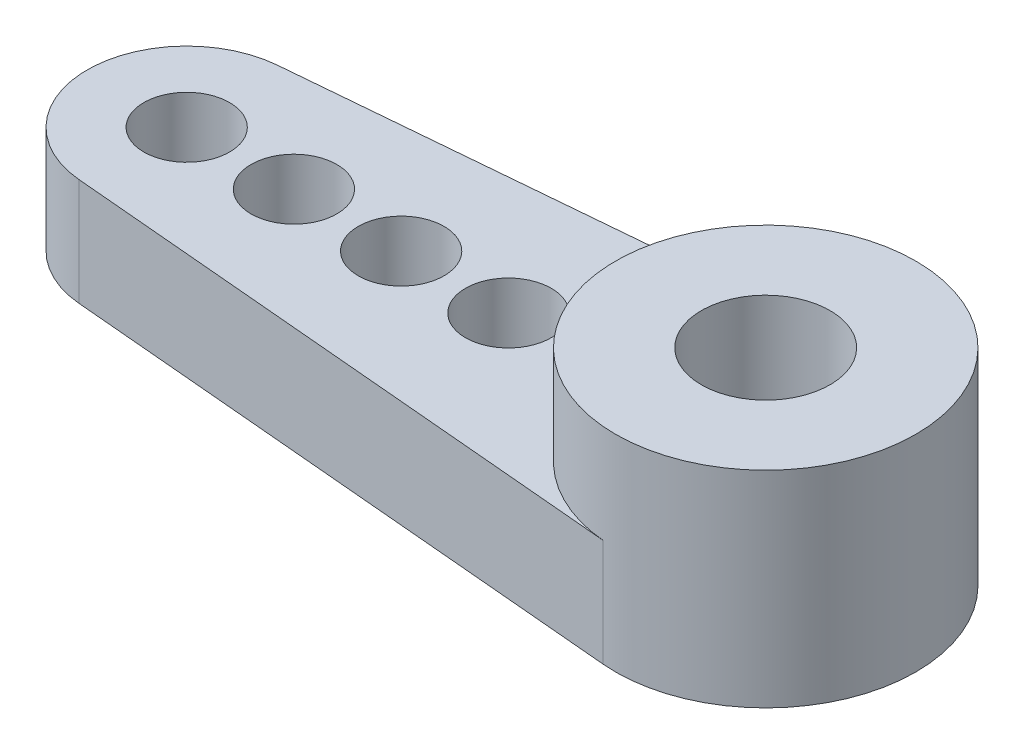
ISO-10303-21;
HEADER;
FILE_DESCRIPTION(('STEP AP214'),'2;1');
FILE_NAME('part.step','',(''),(''),'','','');
FILE_SCHEMA(('AUTOMOTIVE_DESIGN { 1 0 10303 214 1 1 1 1 }'));
ENDSEC;
DATA;
#1=APPLICATION_CONTEXT('core data for automotive mechanical design processes');
#2=APPLICATION_PROTOCOL_DEFINITION('international standard','automotive_design',2000,#1);
#3=PRODUCT_CONTEXT('',#1,'mechanical');
#4=PRODUCT('Part','Part','',(#3));
#5=PRODUCT_RELATED_PRODUCT_CATEGORY('part','',(#4));
#6=PRODUCT_DEFINITION_FORMATION('','',#4);
#7=PRODUCT_DEFINITION_CONTEXT('part definition',#1,'design');
#8=PRODUCT_DEFINITION('design','',#6,#7);
#9=PRODUCT_DEFINITION_SHAPE('','',#8);
#10=(LENGTH_UNIT() NAMED_UNIT(*) SI_UNIT(.MILLI.,.METRE.));
#11=(NAMED_UNIT(*) PLANE_ANGLE_UNIT() SI_UNIT($,.RADIAN.));
#12=(NAMED_UNIT(*) SI_UNIT($,.STERADIAN.) SOLID_ANGLE_UNIT());
#13=UNCERTAINTY_MEASURE_WITH_UNIT(LENGTH_MEASURE(1.E-05),#10,'distance_accuracy_value','');
#14=(GEOMETRIC_REPRESENTATION_CONTEXT(3) GLOBAL_UNCERTAINTY_ASSIGNED_CONTEXT((#13)) GLOBAL_UNIT_ASSIGNED_CONTEXT((#10,
#11,#12)) REPRESENTATION_CONTEXT('',''));
#15=CARTESIAN_POINT('',(0.,0.,0.));
#16=DIRECTION('',(0.,0.,1.));
#17=DIRECTION('',(1.,0.,0.));
#18=AXIS2_PLACEMENT_3D('',#15,#16,#17);
#19=CARTESIAN_POINT('',(-0.305925925925926,2.5,-3.48660426889063));
#20=DIRECTION('',(0.0874074074074074,0.,0.996172648254466));
#21=DIRECTION('',(0.996172648254466,0.,-0.0874074074074074));
#22=AXIS2_PLACEMENT_3D('',#19,#20,#21);
#23=PLANE('',#22);
#24=DIRECTION('',(-0.996172648254466,0.,0.0874074074074074));
#25=VECTOR('',#24,1.);
#26=CARTESIAN_POINT('',(-0.305925925925926,0.,-3.48660426889063));
#27=LINE('',#26,#25);
#28=CARTESIAN_POINT('',(-0.305925925925926,0.,-3.48660426889063));
#29=VERTEX_POINT('',#28);
#30=CARTESIAN_POINT('',(-13.7027851851852,0.,-2.31112054395036));
#31=VERTEX_POINT('',#30);
#32=EDGE_CURVE('E84',#29,#31,#27,.T.);
#33=ORIENTED_EDGE('',*,*,#32,.T.);
#34=DIRECTION('',(0.,-1.,0.));
#35=VECTOR('',#34,1.);
#36=CARTESIAN_POINT('',(-13.7027851851852,2.5,-2.31112054395036));
#37=LINE('',#36,#35);
#38=CARTESIAN_POINT('',(-13.7027851851852,2.5,-2.31112054395036));
#39=VERTEX_POINT('',#38);
#40=EDGE_CURVE('E11',#39,#31,#37,.T.);
#41=ORIENTED_EDGE('',*,*,#40,.F.);
#42=DIRECTION('',(-0.996172648254466,0.,0.0874074074074074));
#43=VECTOR('',#42,1.);
#44=CARTESIAN_POINT('',(-0.305925925925926,2.5,-3.48660426889063));
#45=LINE('',#44,#43);
#46=CARTESIAN_POINT('',(-0.305925925925926,2.5,-3.48660426889063));
#47=VERTEX_POINT('',#46);
#48=EDGE_CURVE('E130',#47,#39,#45,.T.);
#49=ORIENTED_EDGE('',*,*,#48,.F.);
#50=DIRECTION('',(0.,-1.,0.));
#51=VECTOR('',#50,1.);
#52=CARTESIAN_POINT('',(-0.305925925925926,2.5,-3.48660426889063));
#53=LINE('',#52,#51);
#54=EDGE_CURVE('E98',#47,#29,#53,.T.);
#55=ORIENTED_EDGE('',*,*,#54,.T.);
#56=EDGE_LOOP('',(#33,#41,#49,#55));
#57=FACE_BOUND('',#56,.T.);
#58=ADVANCED_FACE('F41',(#57),#23,.F.);
#59=CARTESIAN_POINT('',(-13.5,2.5,0.));
#60=DIRECTION('',(0.,-1.,0.));
#61=DIRECTION('',(0.,0.,-1.));
#62=AXIS2_PLACEMENT_3D('',#59,#60,#61);
#63=CYLINDRICAL_SURFACE('',#62,2.32);
#64=CARTESIAN_POINT('',(-13.5,0.,0.));
#65=DIRECTION('',(0.,1.,0.));
#66=DIRECTION('',(0.,0.,1.));
#67=AXIS2_PLACEMENT_3D('',#64,#65,#66);
#68=CIRCLE('',#67,2.32);
#69=CARTESIAN_POINT('',(-13.7027851851852,0.,2.31112054395036));
#70=VERTEX_POINT('',#69);
#71=EDGE_CURVE('E102',#31,#70,#68,.T.);
#72=ORIENTED_EDGE('',*,*,#71,.T.);
#73=DIRECTION('',(0.,-1.,0.));
#74=VECTOR('',#73,1.);
#75=CARTESIAN_POINT('',(-13.7027851851852,2.5,2.31112054395036));
#76=LINE('',#75,#74);
#77=CARTESIAN_POINT('',(-13.7027851851852,2.5,2.31112054395036));
#78=VERTEX_POINT('',#77);
#79=EDGE_CURVE('E50',#78,#70,#76,.T.);
#80=ORIENTED_EDGE('',*,*,#79,.F.);
#81=CARTESIAN_POINT('',(-13.5,2.5,0.));
#82=DIRECTION('',(0.,1.,0.));
#83=DIRECTION('',(0.,0.,1.));
#84=AXIS2_PLACEMENT_3D('',#81,#82,#83);
#85=CIRCLE('',#84,2.32);
#86=EDGE_CURVE('E58',#39,#78,#85,.T.);
#87=ORIENTED_EDGE('',*,*,#86,.F.);
#88=ORIENTED_EDGE('',*,*,#40,.T.);
#89=EDGE_LOOP('',(#72,#80,#87,#88));
#90=FACE_BOUND('',#89,.T.);
#91=ADVANCED_FACE('F132',(#90),#63,.T.);
#92=CARTESIAN_POINT('',(-0.305925925925925,2.5,3.48660426889063));
#93=DIRECTION('',(-0.0874074074074072,0.,0.996172648254466));
#94=DIRECTION('',(0.996172648254466,0.,0.0874074074074072));
#95=AXIS2_PLACEMENT_3D('',#92,#93,#94);
#96=PLANE('',#95);
#97=DIRECTION('',(-0.996172648254466,0.,-0.0874074074074072));
#98=VECTOR('',#97,1.);
#99=CARTESIAN_POINT('',(-0.305925925925925,0.,3.48660426889063));
#100=LINE('',#99,#98);
#101=CARTESIAN_POINT('',(-0.305925925925925,0.,3.48660426889063));
#102=VERTEX_POINT('',#101);
#103=EDGE_CURVE('E81',#102,#70,#100,.T.);
#104=ORIENTED_EDGE('',*,*,#103,.F.);
#105=DIRECTION('',(0.,-1.,0.));
#106=VECTOR('',#105,1.);
#107=CARTESIAN_POINT('',(-0.305925925925925,2.5,3.48660426889063));
#108=LINE('',#107,#106);
#109=CARTESIAN_POINT('',(-0.305925925925925,2.5,3.48660426889063));
#110=VERTEX_POINT('',#109);
#111=EDGE_CURVE('E93',#110,#102,#108,.T.);
#112=ORIENTED_EDGE('',*,*,#111,.F.);
#113=DIRECTION('',(-0.996172648254466,0.,-0.0874074074074072));
#114=VECTOR('',#113,1.);
#115=CARTESIAN_POINT('',(-0.305925925925925,2.5,3.48660426889063));
#116=LINE('',#115,#114);
#117=EDGE_CURVE('E112',#110,#78,#116,.T.);
#118=ORIENTED_EDGE('',*,*,#117,.T.);
#119=ORIENTED_EDGE('',*,*,#79,.T.);
#120=EDGE_LOOP('',(#104,#112,#118,#119));
#121=FACE_BOUND('',#120,.T.);
#122=ADVANCED_FACE('F100',(#121),#96,.T.);
#123=CARTESIAN_POINT('',(-13.5,2.5,0.));
#124=DIRECTION('',(0.,-1.,0.));
#125=DIRECTION('',(0.,0.,-1.));
#126=AXIS2_PLACEMENT_3D('',#123,#124,#125);
#127=CYLINDRICAL_SURFACE('',#126,1.);
#128=CARTESIAN_POINT('',(-13.5,2.5,0.));
#129=DIRECTION('',(0.,1.,0.));
#130=DIRECTION('',(0.,0.,1.));
#131=AXIS2_PLACEMENT_3D('',#128,#129,#130);
#132=CIRCLE('',#131,1.);
#133=CARTESIAN_POINT('',(-13.5,2.5,1.));
#134=VERTEX_POINT('',#133);
#135=EDGE_CURVE('E134',#134,#134,#132,.T.);
#136=ORIENTED_EDGE('',*,*,#135,.T.);
#137=EDGE_LOOP('',(#136));
#138=FACE_BOUND('',#137,.T.);
#139=CARTESIAN_POINT('',(-13.5,0.,0.));
#140=DIRECTION('',(0.,1.,0.));
#141=DIRECTION('',(0.,0.,1.));
#142=AXIS2_PLACEMENT_3D('',#139,#140,#141);
#143=CIRCLE('',#142,1.);
#144=CARTESIAN_POINT('',(-13.5,0.,1.));
#145=VERTEX_POINT('',#144);
#146=EDGE_CURVE('E127',#145,#145,#143,.T.);
#147=ORIENTED_EDGE('',*,*,#146,.F.);
#148=EDGE_LOOP('',(#147));
#149=FACE_BOUND('',#148,.T.);
#150=ADVANCED_FACE('F177',(#138,#149),#127,.F.);
#151=CARTESIAN_POINT('',(-11.,2.5,0.));
#152=DIRECTION('',(0.,-1.,0.));
#153=DIRECTION('',(0.,0.,-1.));
#154=AXIS2_PLACEMENT_3D('',#151,#152,#153);
#155=CYLINDRICAL_SURFACE('',#154,1.);
#156=CARTESIAN_POINT('',(-11.,2.5,0.));
#157=DIRECTION('',(0.,1.,0.));
#158=DIRECTION('',(0.,0.,1.));
#159=AXIS2_PLACEMENT_3D('',#156,#157,#158);
#160=CIRCLE('',#159,1.);
#161=CARTESIAN_POINT('',(-11.,2.5,1.));
#162=VERTEX_POINT('',#161);
#163=EDGE_CURVE('E137',#162,#162,#160,.T.);
#164=ORIENTED_EDGE('',*,*,#163,.T.);
#165=EDGE_LOOP('',(#164));
#166=FACE_BOUND('',#165,.T.);
#167=CARTESIAN_POINT('',(-11.,0.,0.));
#168=DIRECTION('',(0.,1.,0.));
#169=DIRECTION('',(0.,0.,1.));
#170=AXIS2_PLACEMENT_3D('',#167,#168,#169);
#171=CIRCLE('',#170,1.);
#172=CARTESIAN_POINT('',(-11.,0.,1.));
#173=VERTEX_POINT('',#172);
#174=EDGE_CURVE('E124',#173,#173,#171,.T.);
#175=ORIENTED_EDGE('',*,*,#174,.F.);
#176=EDGE_LOOP('',(#175));
#177=FACE_BOUND('',#176,.T.);
#178=ADVANCED_FACE('F180',(#166,#177),#155,.F.);
#179=CARTESIAN_POINT('',(-8.5,2.5,0.));
#180=DIRECTION('',(0.,-1.,0.));
#181=DIRECTION('',(0.,0.,-1.));
#182=AXIS2_PLACEMENT_3D('',#179,#180,#181);
#183=CYLINDRICAL_SURFACE('',#182,1.);
#184=CARTESIAN_POINT('',(-8.5,2.5,0.));
#185=DIRECTION('',(0.,1.,0.));
#186=DIRECTION('',(0.,0.,1.));
#187=AXIS2_PLACEMENT_3D('',#184,#185,#186);
#188=CIRCLE('',#187,1.);
#189=CARTESIAN_POINT('',(-8.5,2.5,1.));
#190=VERTEX_POINT('',#189);
#191=EDGE_CURVE('E105',#190,#190,#188,.T.);
#192=ORIENTED_EDGE('',*,*,#191,.T.);
#193=EDGE_LOOP('',(#192));
#194=FACE_BOUND('',#193,.T.);
#195=CARTESIAN_POINT('',(-8.5,0.,0.));
#196=DIRECTION('',(0.,1.,0.));
#197=DIRECTION('',(0.,0.,1.));
#198=AXIS2_PLACEMENT_3D('',#195,#196,#197);
#199=CIRCLE('',#198,1.);
#200=CARTESIAN_POINT('',(-8.5,0.,1.));
#201=VERTEX_POINT('',#200);
#202=EDGE_CURVE('E120',#201,#201,#199,.T.);
#203=ORIENTED_EDGE('',*,*,#202,.F.);
#204=EDGE_LOOP('',(#203));
#205=FACE_BOUND('',#204,.T.);
#206=ADVANCED_FACE('F183',(#194,#205),#183,.F.);
#207=CARTESIAN_POINT('',(-6.,2.5,0.));
#208=DIRECTION('',(0.,-1.,0.));
#209=DIRECTION('',(0.,0.,-1.));
#210=AXIS2_PLACEMENT_3D('',#207,#208,#209);
#211=CYLINDRICAL_SURFACE('',#210,1.);
#212=CARTESIAN_POINT('',(-6.,2.5,0.));
#213=DIRECTION('',(0.,1.,0.));
#214=DIRECTION('',(0.,0.,1.));
#215=AXIS2_PLACEMENT_3D('',#212,#213,#214);
#216=CIRCLE('',#215,1.);
#217=CARTESIAN_POINT('',(-6.,2.5,1.));
#218=VERTEX_POINT('',#217);
#219=EDGE_CURVE('E101',#218,#218,#216,.T.);
#220=ORIENTED_EDGE('',*,*,#219,.T.);
#221=EDGE_LOOP('',(#220));
#222=FACE_BOUND('',#221,.T.);
#223=CARTESIAN_POINT('',(-6.,0.,0.));
#224=DIRECTION('',(0.,1.,0.));
#225=DIRECTION('',(0.,0.,1.));
#226=AXIS2_PLACEMENT_3D('',#223,#224,#225);
#227=CIRCLE('',#226,1.);
#228=CARTESIAN_POINT('',(-6.,0.,1.));
#229=VERTEX_POINT('',#228);
#230=EDGE_CURVE('E117',#229,#229,#227,.T.);
#231=ORIENTED_EDGE('',*,*,#230,.F.);
#232=EDGE_LOOP('',(#231));
#233=FACE_BOUND('',#232,.T.);
#234=ADVANCED_FACE('F43',(#222,#233),#211,.F.);
#235=CARTESIAN_POINT('',(0.,2.5,0.));
#236=DIRECTION('',(0.,1.,0.));
#237=DIRECTION('',(0.,0.,1.));
#238=AXIS2_PLACEMENT_3D('',#235,#236,#237);
#239=PLANE('',#238);
#240=ORIENTED_EDGE('',*,*,#219,.F.);
#241=EDGE_LOOP('',(#240));
#242=FACE_BOUND('',#241,.T.);
#243=ORIENTED_EDGE('',*,*,#191,.F.);
#244=EDGE_LOOP('',(#243));
#245=FACE_BOUND('',#244,.T.);
#246=ORIENTED_EDGE('',*,*,#163,.F.);
#247=EDGE_LOOP('',(#246));
#248=FACE_BOUND('',#247,.T.);
#249=ORIENTED_EDGE('',*,*,#135,.F.);
#250=EDGE_LOOP('',(#249));
#251=FACE_BOUND('',#250,.T.);
#252=ORIENTED_EDGE('',*,*,#48,.T.);
#253=ORIENTED_EDGE('',*,*,#86,.T.);
#254=ORIENTED_EDGE('',*,*,#117,.F.);
#255=CARTESIAN_POINT('',(0.,2.5,0.));
#256=DIRECTION('',(0.,1.,0.));
#257=DIRECTION('',(0.,0.,1.));
#258=AXIS2_PLACEMENT_3D('',#255,#256,#257);
#259=CIRCLE('',#258,3.5);
#260=EDGE_CURVE('E97',#47,#110,#259,.T.);
#261=ORIENTED_EDGE('',*,*,#260,.F.);
#262=EDGE_LOOP('',(#252,#253,#254,#261));
#263=FACE_BOUND('',#262,.T.);
#264=ADVANCED_FACE('F133',(#242,#245,#248,#251,#263),#239,.T.);
#265=CARTESIAN_POINT('',(0.,0.,0.));
#266=DIRECTION('',(0.,1.,0.));
#267=DIRECTION('',(0.,0.,1.));
#268=AXIS2_PLACEMENT_3D('',#265,#266,#267);
#269=PLANE('',#268);
#270=ORIENTED_EDGE('',*,*,#230,.T.);
#271=EDGE_LOOP('',(#270));
#272=FACE_BOUND('',#271,.T.);
#273=ORIENTED_EDGE('',*,*,#202,.T.);
#274=EDGE_LOOP('',(#273));
#275=FACE_BOUND('',#274,.T.);
#276=ORIENTED_EDGE('',*,*,#174,.T.);
#277=EDGE_LOOP('',(#276));
#278=FACE_BOUND('',#277,.T.);
#279=ORIENTED_EDGE('',*,*,#146,.T.);
#280=EDGE_LOOP('',(#279));
#281=FACE_BOUND('',#280,.T.);
#282=ORIENTED_EDGE('',*,*,#32,.F.);
#283=CARTESIAN_POINT('',(0.,0.,0.));
#284=DIRECTION('',(0.,1.,0.));
#285=DIRECTION('',(0.,0.,1.));
#286=AXIS2_PLACEMENT_3D('',#283,#284,#285);
#287=CIRCLE('',#286,3.5);
#288=EDGE_CURVE('E77',#102,#29,#287,.T.);
#289=ORIENTED_EDGE('',*,*,#288,.F.);
#290=ORIENTED_EDGE('',*,*,#103,.T.);
#291=ORIENTED_EDGE('',*,*,#71,.F.);
#292=EDGE_LOOP('',(#282,#289,#290,#291));
#293=FACE_BOUND('',#292,.T.);
#294=CARTESIAN_POINT('',(0.,0.,0.));
#295=DIRECTION('',(0.,1.,0.));
#296=DIRECTION('',(0.,0.,1.));
#297=AXIS2_PLACEMENT_3D('',#294,#295,#296);
#298=CIRCLE('',#297,1.5);
#299=CARTESIAN_POINT('',(0.,0.,1.5));
#300=VERTEX_POINT('',#299);
#301=EDGE_CURVE('E89',#300,#300,#298,.T.);
#302=ORIENTED_EDGE('',*,*,#301,.T.);
#303=EDGE_LOOP('',(#302));
#304=FACE_BOUND('',#303,.T.);
#305=ADVANCED_FACE('F79',(#272,#275,#278,#281,#293,#304),#269,.F.);
#306=CARTESIAN_POINT('',(0.,4.8,0.));
#307=DIRECTION('',(0.,-1.,0.));
#308=DIRECTION('',(0.,0.,-1.));
#309=AXIS2_PLACEMENT_3D('',#306,#307,#308);
#310=CYLINDRICAL_SURFACE('',#309,3.5);
#311=CARTESIAN_POINT('',(0.,4.8,0.));
#312=DIRECTION('',(0.,1.,0.));
#313=DIRECTION('',(0.,0.,1.));
#314=AXIS2_PLACEMENT_3D('',#311,#312,#313);
#315=CIRCLE('',#314,3.5);
#316=CARTESIAN_POINT('',(0.,4.8,3.5));
#317=VERTEX_POINT('',#316);
#318=EDGE_CURVE('E121',#317,#317,#315,.T.);
#319=ORIENTED_EDGE('',*,*,#318,.F.);
#320=EDGE_LOOP('',(#319));
#321=FACE_BOUND('',#320,.T.);
#322=ORIENTED_EDGE('',*,*,#288,.T.);
#323=ORIENTED_EDGE('',*,*,#54,.F.);
#324=ORIENTED_EDGE('',*,*,#260,.T.);
#325=ORIENTED_EDGE('',*,*,#111,.T.);
#326=EDGE_LOOP('',(#322,#323,#324,#325));
#327=FACE_BOUND('',#326,.T.);
#328=ADVANCED_FACE('F94',(#321,#327),#310,.T.);
#329=CARTESIAN_POINT('',(0.,4.8,0.));
#330=DIRECTION('',(0.,-1.,0.));
#331=DIRECTION('',(0.,0.,-1.));
#332=AXIS2_PLACEMENT_3D('',#329,#330,#331);
#333=CYLINDRICAL_SURFACE('',#332,1.5);
#334=CARTESIAN_POINT('',(0.,4.8,0.));
#335=DIRECTION('',(0.,1.,0.));
#336=DIRECTION('',(0.,0.,1.));
#337=AXIS2_PLACEMENT_3D('',#334,#335,#336);
#338=CIRCLE('',#337,1.5);
#339=CARTESIAN_POINT('',(0.,4.8,1.5));
#340=VERTEX_POINT('',#339);
#341=EDGE_CURVE('E88',#340,#340,#338,.T.);
#342=ORIENTED_EDGE('',*,*,#341,.T.);
#343=EDGE_LOOP('',(#342));
#344=FACE_BOUND('',#343,.T.);
#345=ORIENTED_EDGE('',*,*,#301,.F.);
#346=EDGE_LOOP('',(#345));
#347=FACE_BOUND('',#346,.T.);
#348=ADVANCED_FACE('F151',(#344,#347),#333,.F.);
#349=CARTESIAN_POINT('',(0.,4.8,0.));
#350=DIRECTION('',(0.,1.,0.));
#351=DIRECTION('',(0.,0.,1.));
#352=AXIS2_PLACEMENT_3D('',#349,#350,#351);
#353=PLANE('',#352);
#354=ORIENTED_EDGE('',*,*,#341,.F.);
#355=EDGE_LOOP('',(#354));
#356=FACE_BOUND('',#355,.T.);
#357=ORIENTED_EDGE('',*,*,#318,.T.);
#358=EDGE_LOOP('',(#357));
#359=FACE_BOUND('',#358,.T.);
#360=ADVANCED_FACE('F154',(#356,#359),#353,.T.);
#361=CLOSED_SHELL('',(#58,#91,#122,#150,#178,#206,#234,#264,#305,#328,#348,#360));
#362=MANIFOLD_SOLID_BREP('B2',#361);
#363=ADVANCED_BREP_SHAPE_REPRESENTATION('',(#18,#362),#14);
#364=SHAPE_DEFINITION_REPRESENTATION(#9,#363);
ENDSEC;
END-ISO-10303-21;
